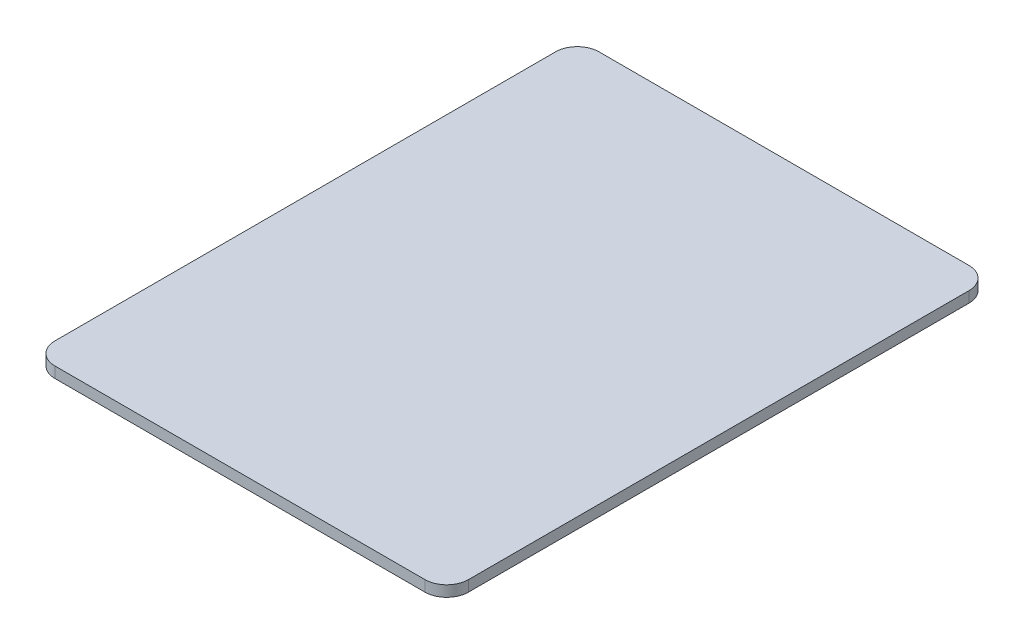
ISO-10303-21;
HEADER;
FILE_DESCRIPTION(('STEP AP214'),'2;1');
FILE_NAME('part.step','',(''),(''),'','','');
FILE_SCHEMA(('AUTOMOTIVE_DESIGN { 1 0 10303 214 1 1 1 1 }'));
ENDSEC;
DATA;
#1=APPLICATION_CONTEXT('core data for automotive mechanical design processes');
#2=APPLICATION_PROTOCOL_DEFINITION('international standard','automotive_design',2000,#1);
#3=PRODUCT_CONTEXT('',#1,'mechanical');
#4=PRODUCT('Part','Part','',(#3));
#5=PRODUCT_RELATED_PRODUCT_CATEGORY('part','',(#4));
#6=PRODUCT_DEFINITION_FORMATION('','',#4);
#7=PRODUCT_DEFINITION_CONTEXT('part definition',#1,'design');
#8=PRODUCT_DEFINITION('design','',#6,#7);
#9=PRODUCT_DEFINITION_SHAPE('','',#8);
#10=(LENGTH_UNIT() NAMED_UNIT(*) SI_UNIT(.MILLI.,.METRE.));
#11=(NAMED_UNIT(*) PLANE_ANGLE_UNIT() SI_UNIT($,.RADIAN.));
#12=(NAMED_UNIT(*) SI_UNIT($,.STERADIAN.) SOLID_ANGLE_UNIT());
#13=UNCERTAINTY_MEASURE_WITH_UNIT(LENGTH_MEASURE(1.E-05),#10,'distance_accuracy_value','');
#14=(GEOMETRIC_REPRESENTATION_CONTEXT(3) GLOBAL_UNCERTAINTY_ASSIGNED_CONTEXT((#13)) GLOBAL_UNIT_ASSIGNED_CONTEXT((#10,
#11,#12)) REPRESENTATION_CONTEXT('',''));
#15=CARTESIAN_POINT('',(0.,0.,0.));
#16=DIRECTION('',(0.,0.,1.));
#17=DIRECTION('',(1.,0.,0.));
#18=AXIS2_PLACEMENT_3D('',#15,#16,#17);
#19=CARTESIAN_POINT('',(0.,5.,0.));
#20=DIRECTION('',(1.,0.,0.));
#21=DIRECTION('',(0.,0.,-1.));
#22=AXIS2_PLACEMENT_3D('',#19,#20,#21);
#23=PLANE('',#22);
#24=DIRECTION('',(0.,0.,1.));
#25=VECTOR('',#24,1.);
#26=CARTESIAN_POINT('',(0.,5.,0.));
#27=LINE('',#26,#25);
#28=CARTESIAN_POINT('',(0.,5.,-240.));
#29=VERTEX_POINT('',#28);
#30=CARTESIAN_POINT('',(0.,5.,-10.));
#31=VERTEX_POINT('',#30);
#32=EDGE_CURVE('E163',#29,#31,#27,.T.);
#33=ORIENTED_EDGE('',*,*,#32,.F.);
#34=DIRECTION('',(0.,-1.,0.));
#35=VECTOR('',#34,1.);
#36=CARTESIAN_POINT('',(0.,5.,-240.));
#37=LINE('',#36,#35);
#38=CARTESIAN_POINT('',(0.,0.,-240.));
#39=VERTEX_POINT('',#38);
#40=EDGE_CURVE('E193',#29,#39,#37,.T.);
#41=ORIENTED_EDGE('',*,*,#40,.T.);
#42=DIRECTION('',(0.,0.,1.));
#43=VECTOR('',#42,1.);
#44=CARTESIAN_POINT('',(0.,0.,0.));
#45=LINE('',#44,#43);
#46=CARTESIAN_POINT('',(0.,0.,-10.));
#47=VERTEX_POINT('',#46);
#48=EDGE_CURVE('E152',#39,#47,#45,.T.);
#49=ORIENTED_EDGE('',*,*,#48,.T.);
#50=DIRECTION('',(0.,-1.,0.));
#51=VECTOR('',#50,1.);
#52=CARTESIAN_POINT('',(0.,5.,-10.));
#53=LINE('',#52,#51);
#54=EDGE_CURVE('E179',#47,#31,#53,.F.);
#55=ORIENTED_EDGE('',*,*,#54,.T.);
#56=EDGE_LOOP('',(#33,#41,#49,#55));
#57=FACE_BOUND('',#56,.T.);
#58=ADVANCED_FACE('F39',(#57),#23,.F.);
#59=CARTESIAN_POINT('',(0.,5.,0.));
#60=DIRECTION('',(0.,0.,-1.));
#61=DIRECTION('',(-1.,0.,0.));
#62=AXIS2_PLACEMENT_3D('',#59,#60,#61);
#63=PLANE('',#62);
#64=DIRECTION('',(1.,0.,0.));
#65=VECTOR('',#64,1.);
#66=CARTESIAN_POINT('',(0.,5.,0.));
#67=LINE('',#66,#65);
#68=CARTESIAN_POINT('',(10.,5.,0.));
#69=VERTEX_POINT('',#68);
#70=CARTESIAN_POINT('',(180.,5.,0.));
#71=VERTEX_POINT('',#70);
#72=EDGE_CURVE('E167',#69,#71,#67,.T.);
#73=ORIENTED_EDGE('',*,*,#72,.F.);
#74=DIRECTION('',(0.,-1.,0.));
#75=VECTOR('',#74,1.);
#76=CARTESIAN_POINT('',(10.,5.,0.));
#77=LINE('',#76,#75);
#78=CARTESIAN_POINT('',(10.,0.,0.));
#79=VERTEX_POINT('',#78);
#80=EDGE_CURVE('E11',#69,#79,#77,.T.);
#81=ORIENTED_EDGE('',*,*,#80,.T.);
#82=DIRECTION('',(1.,0.,0.));
#83=VECTOR('',#82,1.);
#84=CARTESIAN_POINT('',(0.,0.,0.));
#85=LINE('',#84,#83);
#86=CARTESIAN_POINT('',(180.,0.,0.));
#87=VERTEX_POINT('',#86);
#88=EDGE_CURVE('E157',#79,#87,#85,.T.);
#89=ORIENTED_EDGE('',*,*,#88,.T.);
#90=DIRECTION('',(0.,-1.,0.));
#91=VECTOR('',#90,1.);
#92=CARTESIAN_POINT('',(180.,5.,0.));
#93=LINE('',#92,#91);
#94=EDGE_CURVE('E48',#87,#71,#93,.F.);
#95=ORIENTED_EDGE('',*,*,#94,.T.);
#96=EDGE_LOOP('',(#73,#81,#89,#95));
#97=FACE_BOUND('',#96,.T.);
#98=ADVANCED_FACE('F238',(#97),#63,.F.);
#99=CARTESIAN_POINT('',(190.,5.,0.));
#100=DIRECTION('',(-1.,0.,0.));
#101=DIRECTION('',(0.,0.,1.));
#102=AXIS2_PLACEMENT_3D('',#99,#100,#101);
#103=PLANE('',#102);
#104=DIRECTION('',(0.,0.,-1.));
#105=VECTOR('',#104,1.);
#106=CARTESIAN_POINT('',(190.,0.,0.));
#107=LINE('',#106,#105);
#108=CARTESIAN_POINT('',(190.,0.,-10.));
#109=VERTEX_POINT('',#108);
#110=CARTESIAN_POINT('',(190.,0.,-240.));
#111=VERTEX_POINT('',#110);
#112=EDGE_CURVE('E184',#109,#111,#107,.T.);
#113=ORIENTED_EDGE('',*,*,#112,.T.);
#114=DIRECTION('',(0.,-1.,0.));
#115=VECTOR('',#114,1.);
#116=CARTESIAN_POINT('',(190.,5.,-240.));
#117=LINE('',#116,#115);
#118=CARTESIAN_POINT('',(190.,5.,-240.));
#119=VERTEX_POINT('',#118);
#120=EDGE_CURVE('E232',#111,#119,#117,.F.);
#121=ORIENTED_EDGE('',*,*,#120,.T.);
#122=DIRECTION('',(0.,0.,-1.));
#123=VECTOR('',#122,1.);
#124=CARTESIAN_POINT('',(190.,5.,0.));
#125=LINE('',#124,#123);
#126=CARTESIAN_POINT('',(190.,5.,-10.));
#127=VERTEX_POINT('',#126);
#128=EDGE_CURVE('E172',#127,#119,#125,.T.);
#129=ORIENTED_EDGE('',*,*,#128,.F.);
#130=DIRECTION('',(0.,-1.,0.));
#131=VECTOR('',#130,1.);
#132=CARTESIAN_POINT('',(190.,5.,-10.));
#133=LINE('',#132,#131);
#134=EDGE_CURVE('E228',#127,#109,#133,.T.);
#135=ORIENTED_EDGE('',*,*,#134,.T.);
#136=EDGE_LOOP('',(#113,#121,#129,#135));
#137=FACE_BOUND('',#136,.T.);
#138=ADVANCED_FACE('F250',(#137),#103,.F.);
#139=CARTESIAN_POINT('',(0.,5.,-250.));
#140=DIRECTION('',(0.,0.,1.));
#141=DIRECTION('',(1.,0.,0.));
#142=AXIS2_PLACEMENT_3D('',#139,#140,#141);
#143=PLANE('',#142);
#144=DIRECTION('',(-1.,0.,0.));
#145=VECTOR('',#144,1.);
#146=CARTESIAN_POINT('',(0.,0.,-250.));
#147=LINE('',#146,#145);
#148=CARTESIAN_POINT('',(180.,0.,-250.));
#149=VERTEX_POINT('',#148);
#150=CARTESIAN_POINT('',(10.,0.,-250.));
#151=VERTEX_POINT('',#150);
#152=EDGE_CURVE('E168',#149,#151,#147,.T.);
#153=ORIENTED_EDGE('',*,*,#152,.T.);
#154=DIRECTION('',(0.,-1.,0.));
#155=VECTOR('',#154,1.);
#156=CARTESIAN_POINT('',(10.,5.,-250.));
#157=LINE('',#156,#155);
#158=CARTESIAN_POINT('',(10.,5.,-250.));
#159=VERTEX_POINT('',#158);
#160=EDGE_CURVE('E213',#151,#159,#157,.F.);
#161=ORIENTED_EDGE('',*,*,#160,.T.);
#162=DIRECTION('',(-1.,0.,0.));
#163=VECTOR('',#162,1.);
#164=CARTESIAN_POINT('',(0.,5.,-250.));
#165=LINE('',#164,#163);
#166=CARTESIAN_POINT('',(180.,5.,-250.));
#167=VERTEX_POINT('',#166);
#168=EDGE_CURVE('E176',#167,#159,#165,.T.);
#169=ORIENTED_EDGE('',*,*,#168,.F.);
#170=DIRECTION('',(0.,-1.,0.));
#171=VECTOR('',#170,1.);
#172=CARTESIAN_POINT('',(180.,5.,-250.));
#173=LINE('',#172,#171);
#174=EDGE_CURVE('E209',#167,#149,#173,.T.);
#175=ORIENTED_EDGE('',*,*,#174,.T.);
#176=EDGE_LOOP('',(#153,#161,#169,#175));
#177=FACE_BOUND('',#176,.T.);
#178=ADVANCED_FACE('F262',(#177),#143,.F.);
#179=CARTESIAN_POINT('',(0.,5.,0.));
#180=DIRECTION('',(0.,-1.,0.));
#181=DIRECTION('',(0.,0.,-1.));
#182=AXIS2_PLACEMENT_3D('',#179,#180,#181);
#183=PLANE('',#182);
#184=ORIENTED_EDGE('',*,*,#168,.T.);
#185=CARTESIAN_POINT('',(10.,5.,-240.));
#186=DIRECTION('',(0.,-1.,0.));
#187=DIRECTION('',(0.,0.,-1.));
#188=AXIS2_PLACEMENT_3D('',#185,#186,#187);
#189=CIRCLE('',#188,10.);
#190=EDGE_CURVE('E225',#159,#29,#189,.F.);
#191=ORIENTED_EDGE('',*,*,#190,.T.);
#192=ORIENTED_EDGE('',*,*,#32,.T.);
#193=CARTESIAN_POINT('',(10.,5.,-10.));
#194=DIRECTION('',(0.,-1.,0.));
#195=DIRECTION('',(0.,0.,-1.));
#196=AXIS2_PLACEMENT_3D('',#193,#194,#195);
#197=CIRCLE('',#196,10.);
#198=EDGE_CURVE('E219',#31,#69,#197,.F.);
#199=ORIENTED_EDGE('',*,*,#198,.T.);
#200=ORIENTED_EDGE('',*,*,#72,.T.);
#201=CARTESIAN_POINT('',(180.,5.,-10.));
#202=DIRECTION('',(0.,-1.,0.));
#203=DIRECTION('',(0.,0.,-1.));
#204=AXIS2_PLACEMENT_3D('',#201,#202,#203);
#205=CIRCLE('',#204,10.);
#206=EDGE_CURVE('E216',#71,#127,#205,.F.);
#207=ORIENTED_EDGE('',*,*,#206,.T.);
#208=ORIENTED_EDGE('',*,*,#128,.T.);
#209=CARTESIAN_POINT('',(180.,5.,-240.));
#210=DIRECTION('',(0.,-1.,0.));
#211=DIRECTION('',(0.,0.,-1.));
#212=AXIS2_PLACEMENT_3D('',#209,#210,#211);
#213=CIRCLE('',#212,10.);
#214=EDGE_CURVE('E222',#119,#167,#213,.F.);
#215=ORIENTED_EDGE('',*,*,#214,.T.);
#216=EDGE_LOOP('',(#184,#191,#192,#199,#200,#207,#208,#215));
#217=FACE_BOUND('',#216,.T.);
#218=ADVANCED_FACE('F244',(#217),#183,.F.);
#219=CARTESIAN_POINT('',(0.,0.,0.));
#220=DIRECTION('',(0.,-1.,0.));
#221=DIRECTION('',(0.,0.,-1.));
#222=AXIS2_PLACEMENT_3D('',#219,#220,#221);
#223=PLANE('',#222);
#224=DIRECTION('',(0.,0.,1.));
#225=VECTOR('',#224,1.);
#226=CARTESIAN_POINT('',(170.,0.,-9.99999999999995));
#227=LINE('',#226,#225);
#228=CARTESIAN_POINT('',(170.,0.,-240.));
#229=VERTEX_POINT('',#228);
#230=CARTESIAN_POINT('',(170.,0.,-9.99999999999995));
#231=VERTEX_POINT('',#230);
#232=EDGE_CURVE('E55',#229,#231,#227,.T.);
#233=ORIENTED_EDGE('',*,*,#232,.F.);
#234=DIRECTION('',(1.,0.,0.));
#235=VECTOR('',#234,1.);
#236=CARTESIAN_POINT('',(20.,0.,-240.));
#237=LINE('',#236,#235);
#238=CARTESIAN_POINT('',(20.,0.,-240.));
#239=VERTEX_POINT('',#238);
#240=EDGE_CURVE('E59',#239,#229,#237,.T.);
#241=ORIENTED_EDGE('',*,*,#240,.F.);
#242=DIRECTION('',(0.,0.,-1.));
#243=VECTOR('',#242,1.);
#244=CARTESIAN_POINT('',(20.,0.,-9.99999999999995));
#245=LINE('',#244,#243);
#246=CARTESIAN_POINT('',(20.,0.,-9.99999999999995));
#247=VERTEX_POINT('',#246);
#248=EDGE_CURVE('E386',#247,#239,#245,.T.);
#249=ORIENTED_EDGE('',*,*,#248,.F.);
#250=DIRECTION('',(-1.,0.,0.));
#251=VECTOR('',#250,1.);
#252=CARTESIAN_POINT('',(20.,0.,-9.99999999999995));
#253=LINE('',#252,#251);
#254=EDGE_CURVE('E396',#231,#247,#253,.T.);
#255=ORIENTED_EDGE('',*,*,#254,.F.);
#256=EDGE_LOOP('',(#233,#241,#249,#255));
#257=FACE_BOUND('',#256,.T.);
#258=ORIENTED_EDGE('',*,*,#48,.F.);
#259=CARTESIAN_POINT('',(10.,0.,-240.));
#260=DIRECTION('',(0.,-1.,0.));
#261=DIRECTION('',(0.,0.,-1.));
#262=AXIS2_PLACEMENT_3D('',#259,#260,#261);
#263=CIRCLE('',#262,10.);
#264=EDGE_CURVE('E206',#39,#151,#263,.T.);
#265=ORIENTED_EDGE('',*,*,#264,.T.);
#266=ORIENTED_EDGE('',*,*,#152,.F.);
#267=CARTESIAN_POINT('',(180.,0.,-240.));
#268=DIRECTION('',(0.,-1.,0.));
#269=DIRECTION('',(0.,0.,-1.));
#270=AXIS2_PLACEMENT_3D('',#267,#268,#269);
#271=CIRCLE('',#270,10.);
#272=EDGE_CURVE('E203',#149,#111,#271,.T.);
#273=ORIENTED_EDGE('',*,*,#272,.T.);
#274=ORIENTED_EDGE('',*,*,#112,.F.);
#275=CARTESIAN_POINT('',(180.,0.,-10.));
#276=DIRECTION('',(0.,-1.,0.));
#277=DIRECTION('',(0.,0.,-1.));
#278=AXIS2_PLACEMENT_3D('',#275,#276,#277);
#279=CIRCLE('',#278,10.);
#280=EDGE_CURVE('E197',#109,#87,#279,.T.);
#281=ORIENTED_EDGE('',*,*,#280,.T.);
#282=ORIENTED_EDGE('',*,*,#88,.F.);
#283=CARTESIAN_POINT('',(10.,0.,-10.));
#284=DIRECTION('',(0.,-1.,0.));
#285=DIRECTION('',(0.,0.,-1.));
#286=AXIS2_PLACEMENT_3D('',#283,#284,#285);
#287=CIRCLE('',#286,10.);
#288=EDGE_CURVE('E200',#79,#47,#287,.T.);
#289=ORIENTED_EDGE('',*,*,#288,.T.);
#290=EDGE_LOOP('',(#258,#265,#266,#273,#274,#281,#282,#289));
#291=FACE_BOUND('',#290,.T.);
#292=ADVANCED_FACE('F254',(#257,#291),#223,.T.);
#293=CARTESIAN_POINT('',(10.,5.,-240.));
#294=DIRECTION('',(0.,-1.,0.));
#295=DIRECTION('',(0.,0.,-1.));
#296=AXIS2_PLACEMENT_3D('',#293,#294,#295);
#297=CYLINDRICAL_SURFACE('',#296,10.);
#298=ORIENTED_EDGE('',*,*,#190,.F.);
#299=ORIENTED_EDGE('',*,*,#160,.F.);
#300=ORIENTED_EDGE('',*,*,#264,.F.);
#301=ORIENTED_EDGE('',*,*,#40,.F.);
#302=EDGE_LOOP('',(#298,#299,#300,#301));
#303=FACE_BOUND('',#302,.T.);
#304=ADVANCED_FACE('F268',(#303),#297,.T.);
#305=CARTESIAN_POINT('',(180.,5.,-240.));
#306=DIRECTION('',(0.,-1.,0.));
#307=DIRECTION('',(0.,0.,-1.));
#308=AXIS2_PLACEMENT_3D('',#305,#306,#307);
#309=CYLINDRICAL_SURFACE('',#308,10.);
#310=ORIENTED_EDGE('',*,*,#214,.F.);
#311=ORIENTED_EDGE('',*,*,#120,.F.);
#312=ORIENTED_EDGE('',*,*,#272,.F.);
#313=ORIENTED_EDGE('',*,*,#174,.F.);
#314=EDGE_LOOP('',(#310,#311,#312,#313));
#315=FACE_BOUND('',#314,.T.);
#316=ADVANCED_FACE('F259',(#315),#309,.T.);
#317=CARTESIAN_POINT('',(10.,5.,-10.));
#318=DIRECTION('',(0.,-1.,0.));
#319=DIRECTION('',(0.,0.,-1.));
#320=AXIS2_PLACEMENT_3D('',#317,#318,#319);
#321=CYLINDRICAL_SURFACE('',#320,10.);
#322=ORIENTED_EDGE('',*,*,#198,.F.);
#323=ORIENTED_EDGE('',*,*,#54,.F.);
#324=ORIENTED_EDGE('',*,*,#288,.F.);
#325=ORIENTED_EDGE('',*,*,#80,.F.);
#326=EDGE_LOOP('',(#322,#323,#324,#325));
#327=FACE_BOUND('',#326,.T.);
#328=ADVANCED_FACE('F272',(#327),#321,.T.);
#329=CARTESIAN_POINT('',(180.,5.,-10.));
#330=DIRECTION('',(0.,-1.,0.));
#331=DIRECTION('',(0.,0.,-1.));
#332=AXIS2_PLACEMENT_3D('',#329,#330,#331);
#333=CYLINDRICAL_SURFACE('',#332,10.);
#334=ORIENTED_EDGE('',*,*,#206,.F.);
#335=ORIENTED_EDGE('',*,*,#94,.F.);
#336=ORIENTED_EDGE('',*,*,#280,.F.);
#337=ORIENTED_EDGE('',*,*,#134,.F.);
#338=EDGE_LOOP('',(#334,#335,#336,#337));
#339=FACE_BOUND('',#338,.T.);
#340=ADVANCED_FACE('F41',(#339),#333,.T.);
#341=CARTESIAN_POINT('',(170.,-10.,-9.99999999999995));
#342=DIRECTION('',(-1.,0.,0.));
#343=DIRECTION('',(0.,0.,1.));
#344=AXIS2_PLACEMENT_3D('',#341,#342,#343);
#345=PLANE('',#344);
#346=ORIENTED_EDGE('',*,*,#232,.T.);
#347=DIRECTION('',(0.,1.,0.));
#348=VECTOR('',#347,1.);
#349=CARTESIAN_POINT('',(170.,-10.,-9.99999999999995));
#350=LINE('',#349,#348);
#351=CARTESIAN_POINT('',(170.,-10.,-9.99999999999995));
#352=VERTEX_POINT('',#351);
#353=EDGE_CURVE('E132',#352,#231,#350,.T.);
#354=ORIENTED_EDGE('',*,*,#353,.F.);
#355=DIRECTION('',(0.,0.,1.));
#356=VECTOR('',#355,1.);
#357=CARTESIAN_POINT('',(170.,-10.,-9.99999999999995));
#358=LINE('',#357,#356);
#359=CARTESIAN_POINT('',(170.,-10.,-240.));
#360=VERTEX_POINT('',#359);
#361=EDGE_CURVE('E139',#360,#352,#358,.T.);
#362=ORIENTED_EDGE('',*,*,#361,.F.);
#363=DIRECTION('',(0.,1.,0.));
#364=VECTOR('',#363,1.);
#365=CARTESIAN_POINT('',(170.,-10.,-240.));
#366=LINE('',#365,#364);
#367=EDGE_CURVE('E383',#360,#229,#366,.T.);
#368=ORIENTED_EDGE('',*,*,#367,.T.);
#369=EDGE_LOOP('',(#346,#354,#362,#368));
#370=FACE_BOUND('',#369,.T.);
#371=ADVANCED_FACE('F150',(#370),#345,.F.);
#372=CARTESIAN_POINT('',(20.,-10.,-9.99999999999995));
#373=DIRECTION('',(0.,0.,-1.));
#374=DIRECTION('',(-1.,0.,0.));
#375=AXIS2_PLACEMENT_3D('',#372,#373,#374);
#376=PLANE('',#375);
#377=ORIENTED_EDGE('',*,*,#254,.T.);
#378=DIRECTION('',(0.,1.,0.));
#379=VECTOR('',#378,1.);
#380=CARTESIAN_POINT('',(20.,-10.,-9.99999999999995));
#381=LINE('',#380,#379);
#382=CARTESIAN_POINT('',(20.,-10.,-9.99999999999995));
#383=VERTEX_POINT('',#382);
#384=EDGE_CURVE('E134',#383,#247,#381,.T.);
#385=ORIENTED_EDGE('',*,*,#384,.F.);
#386=DIRECTION('',(-1.,0.,0.));
#387=VECTOR('',#386,1.);
#388=CARTESIAN_POINT('',(20.,-10.,-9.99999999999995));
#389=LINE('',#388,#387);
#390=EDGE_CURVE('E127',#352,#383,#389,.T.);
#391=ORIENTED_EDGE('',*,*,#390,.F.);
#392=ORIENTED_EDGE('',*,*,#353,.T.);
#393=EDGE_LOOP('',(#377,#385,#391,#392));
#394=FACE_BOUND('',#393,.T.);
#395=ADVANCED_FACE('F130',(#394),#376,.F.);
#396=CARTESIAN_POINT('',(20.,-10.,-9.99999999999995));
#397=DIRECTION('',(1.,0.,0.));
#398=DIRECTION('',(0.,0.,-1.));
#399=AXIS2_PLACEMENT_3D('',#396,#397,#398);
#400=PLANE('',#399);
#401=ORIENTED_EDGE('',*,*,#248,.T.);
#402=DIRECTION('',(0.,1.,0.));
#403=VECTOR('',#402,1.);
#404=CARTESIAN_POINT('',(20.,-10.,-240.));
#405=LINE('',#404,#403);
#406=CARTESIAN_POINT('',(20.,-10.,-240.));
#407=VERTEX_POINT('',#406);
#408=EDGE_CURVE('E159',#407,#239,#405,.T.);
#409=ORIENTED_EDGE('',*,*,#408,.F.);
#410=DIRECTION('',(0.,0.,-1.));
#411=VECTOR('',#410,1.);
#412=CARTESIAN_POINT('',(20.,-10.,-9.99999999999995));
#413=LINE('',#412,#411);
#414=EDGE_CURVE('E138',#383,#407,#413,.T.);
#415=ORIENTED_EDGE('',*,*,#414,.F.);
#416=ORIENTED_EDGE('',*,*,#384,.T.);
#417=EDGE_LOOP('',(#401,#409,#415,#416));
#418=FACE_BOUND('',#417,.T.);
#419=ADVANCED_FACE('F350',(#418),#400,.F.);
#420=CARTESIAN_POINT('',(20.,-10.,-240.));
#421=DIRECTION('',(0.,0.,1.));
#422=DIRECTION('',(1.,0.,0.));
#423=AXIS2_PLACEMENT_3D('',#420,#421,#422);
#424=PLANE('',#423);
#425=ORIENTED_EDGE('',*,*,#240,.T.);
#426=ORIENTED_EDGE('',*,*,#367,.F.);
#427=DIRECTION('',(1.,0.,0.));
#428=VECTOR('',#427,1.);
#429=CARTESIAN_POINT('',(20.,-10.,-240.));
#430=LINE('',#429,#428);
#431=EDGE_CURVE('E144',#407,#360,#430,.T.);
#432=ORIENTED_EDGE('',*,*,#431,.F.);
#433=ORIENTED_EDGE('',*,*,#408,.T.);
#434=EDGE_LOOP('',(#425,#426,#432,#433));
#435=FACE_BOUND('',#434,.T.);
#436=ADVANCED_FACE('F358',(#435),#424,.F.);
#437=CARTESIAN_POINT('',(0.,-10.,0.));
#438=DIRECTION('',(0.,-1.,0.));
#439=DIRECTION('',(0.,0.,-1.));
#440=AXIS2_PLACEMENT_3D('',#437,#438,#439);
#441=PLANE('',#440);
#442=ORIENTED_EDGE('',*,*,#361,.T.);
#443=ORIENTED_EDGE('',*,*,#390,.T.);
#444=ORIENTED_EDGE('',*,*,#414,.T.);
#445=ORIENTED_EDGE('',*,*,#431,.T.);
#446=EDGE_LOOP('',(#442,#443,#444,#445));
#447=FACE_BOUND('',#446,.T.);
#448=ADVANCED_FACE('F142',(#447),#441,.T.);
#449=CLOSED_SHELL('',(#58,#98,#138,#178,#218,#292,#304,#316,#328,#340,#371,#395,#419,#436,#448));
#450=MANIFOLD_SOLID_BREP('B2',#449);
#451=ADVANCED_BREP_SHAPE_REPRESENTATION('',(#18,#450),#14);
#452=SHAPE_DEFINITION_REPRESENTATION(#9,#451);
ENDSEC;
END-ISO-10303-21;
